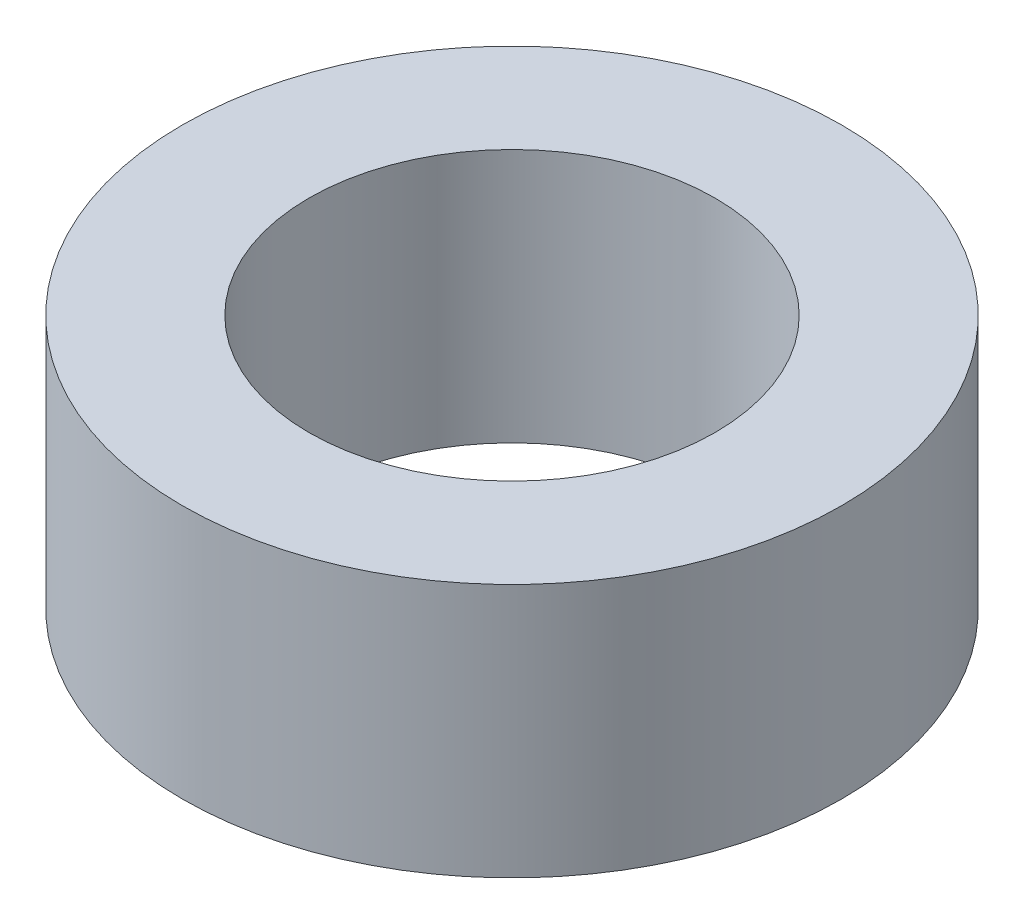
ISO-10303-21;
HEADER;
FILE_DESCRIPTION(('STEP AP214'),'2;1');
FILE_NAME('part.step','',(''),(''),'','','');
FILE_SCHEMA(('AUTOMOTIVE_DESIGN { 1 0 10303 214 1 1 1 1 }'));
ENDSEC;
DATA;
#1=APPLICATION_CONTEXT('core data for automotive mechanical design processes');
#2=APPLICATION_PROTOCOL_DEFINITION('international standard','automotive_design',2000,#1);
#3=PRODUCT_CONTEXT('',#1,'mechanical');
#4=PRODUCT('Part','Part','',(#3));
#5=PRODUCT_RELATED_PRODUCT_CATEGORY('part','',(#4));
#6=PRODUCT_DEFINITION_FORMATION('','',#4);
#7=PRODUCT_DEFINITION_CONTEXT('part definition',#1,'design');
#8=PRODUCT_DEFINITION('design','',#6,#7);
#9=PRODUCT_DEFINITION_SHAPE('','',#8);
#10=(LENGTH_UNIT() NAMED_UNIT(*) SI_UNIT(.MILLI.,.METRE.));
#11=(NAMED_UNIT(*) PLANE_ANGLE_UNIT() SI_UNIT($,.RADIAN.));
#12=(NAMED_UNIT(*) SI_UNIT($,.STERADIAN.) SOLID_ANGLE_UNIT());
#13=UNCERTAINTY_MEASURE_WITH_UNIT(LENGTH_MEASURE(1.E-05),#10,'distance_accuracy_value','');
#14=(GEOMETRIC_REPRESENTATION_CONTEXT(3) GLOBAL_UNCERTAINTY_ASSIGNED_CONTEXT((#13)) GLOBAL_UNIT_ASSIGNED_CONTEXT((#10,
#11,#12)) REPRESENTATION_CONTEXT('',''));
#15=CARTESIAN_POINT('',(0.,0.,0.));
#16=DIRECTION('',(0.,0.,1.));
#17=DIRECTION('',(1.,0.,0.));
#18=AXIS2_PLACEMENT_3D('',#15,#16,#17);
#19=CARTESIAN_POINT('',(0.,3.6703,0.));
#20=DIRECTION('',(0.,1.,0.));
#21=DIRECTION('',(0.,0.,1.));
#22=AXIS2_PLACEMENT_3D('',#19,#20,#21);
#23=PLANE('',#22);
#24=CARTESIAN_POINT('',(0.,3.6703,0.));
#25=DIRECTION('',(0.,1.,0.));
#26=DIRECTION('',(0.,0.,1.));
#27=AXIS2_PLACEMENT_3D('',#24,#25,#26);
#28=CIRCLE('',#27,4.7625);
#29=CARTESIAN_POINT('',(0.,3.6703,4.7625));
#30=VERTEX_POINT('',#29);
#31=EDGE_CURVE('E10',#30,#30,#28,.T.);
#32=ORIENTED_EDGE('',*,*,#31,.T.);
#33=EDGE_LOOP('',(#32));
#34=FACE_BOUND('',#33,.T.);
#35=CARTESIAN_POINT('',(0.,3.6703,0.));
#36=DIRECTION('',(0.,1.,0.));
#37=DIRECTION('',(0.,0.,1.));
#38=AXIS2_PLACEMENT_3D('',#35,#36,#37);
#39=CIRCLE('',#38,2.9337);
#40=CARTESIAN_POINT('',(0.,3.6703,2.9337));
#41=VERTEX_POINT('',#40);
#42=EDGE_CURVE('E41',#41,#41,#39,.T.);
#43=ORIENTED_EDGE('',*,*,#42,.F.);
#44=EDGE_LOOP('',(#43));
#45=FACE_BOUND('',#44,.T.);
#46=ADVANCED_FACE('F30',(#34,#45),#23,.T.);
#47=CARTESIAN_POINT('',(0.,0.,0.));
#48=DIRECTION('',(0.,1.,0.));
#49=DIRECTION('',(0.,0.,1.));
#50=AXIS2_PLACEMENT_3D('',#47,#48,#49);
#51=PLANE('',#50);
#52=CARTESIAN_POINT('',(0.,0.,0.));
#53=DIRECTION('',(0.,1.,0.));
#54=DIRECTION('',(0.,0.,1.));
#55=AXIS2_PLACEMENT_3D('',#52,#53,#54);
#56=CIRCLE('',#55,4.7625);
#57=CARTESIAN_POINT('',(0.,0.,4.7625));
#58=VERTEX_POINT('',#57);
#59=EDGE_CURVE('E34',#58,#58,#56,.T.);
#60=ORIENTED_EDGE('',*,*,#59,.F.);
#61=EDGE_LOOP('',(#60));
#62=FACE_BOUND('',#61,.T.);
#63=CARTESIAN_POINT('',(0.,0.,0.));
#64=DIRECTION('',(0.,1.,0.));
#65=DIRECTION('',(0.,0.,1.));
#66=AXIS2_PLACEMENT_3D('',#63,#64,#65);
#67=CIRCLE('',#66,2.9337);
#68=CARTESIAN_POINT('',(0.,0.,2.9337));
#69=VERTEX_POINT('',#68);
#70=EDGE_CURVE('E43',#69,#69,#67,.T.);
#71=ORIENTED_EDGE('',*,*,#70,.T.);
#72=EDGE_LOOP('',(#71));
#73=FACE_BOUND('',#72,.T.);
#74=ADVANCED_FACE('F53',(#62,#73),#51,.F.);
#75=CARTESIAN_POINT('',(0.,3.6703,0.));
#76=DIRECTION('',(0.,-1.,0.));
#77=DIRECTION('',(0.,0.,-1.));
#78=AXIS2_PLACEMENT_3D('',#75,#76,#77);
#79=CYLINDRICAL_SURFACE('',#78,4.7625);
#80=ORIENTED_EDGE('',*,*,#31,.F.);
#81=EDGE_LOOP('',(#80));
#82=FACE_BOUND('',#81,.T.);
#83=ORIENTED_EDGE('',*,*,#59,.T.);
#84=EDGE_LOOP('',(#83));
#85=FACE_BOUND('',#84,.T.);
#86=ADVANCED_FACE('F32',(#82,#85),#79,.T.);
#87=CARTESIAN_POINT('',(0.,3.6703,0.));
#88=DIRECTION('',(0.,-1.,0.));
#89=DIRECTION('',(0.,0.,-1.));
#90=AXIS2_PLACEMENT_3D('',#87,#88,#89);
#91=CYLINDRICAL_SURFACE('',#90,2.9337);
#92=ORIENTED_EDGE('',*,*,#42,.T.);
#93=EDGE_LOOP('',(#92));
#94=FACE_BOUND('',#93,.T.);
#95=ORIENTED_EDGE('',*,*,#70,.F.);
#96=EDGE_LOOP('',(#95));
#97=FACE_BOUND('',#96,.T.);
#98=ADVANCED_FACE('F49',(#94,#97),#91,.F.);
#99=CLOSED_SHELL('',(#46,#74,#86,#98));
#100=MANIFOLD_SOLID_BREP('B2',#99);
#101=ADVANCED_BREP_SHAPE_REPRESENTATION('',(#18,#100),#14);
#102=SHAPE_DEFINITION_REPRESENTATION(#9,#101);
ENDSEC;
END-ISO-10303-21;
